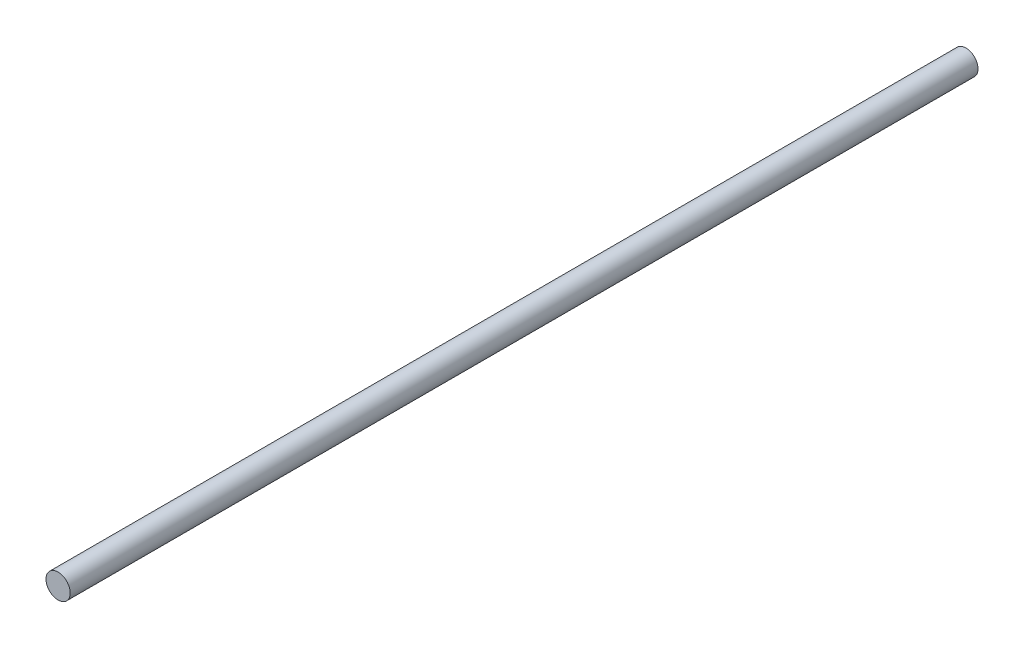
ISO-10303-21;
HEADER;
FILE_DESCRIPTION(('STEP AP214'),'2;1');
FILE_NAME('part.step','',(''),(''),'','','');
FILE_SCHEMA(('AUTOMOTIVE_DESIGN { 1 0 10303 214 1 1 1 1 }'));
ENDSEC;
DATA;
#1=APPLICATION_CONTEXT('core data for automotive mechanical design processes');
#2=APPLICATION_PROTOCOL_DEFINITION('international standard','automotive_design',2000,#1);
#3=PRODUCT_CONTEXT('',#1,'mechanical');
#4=PRODUCT('Part','Part','',(#3));
#5=PRODUCT_RELATED_PRODUCT_CATEGORY('part','',(#4));
#6=PRODUCT_DEFINITION_FORMATION('','',#4);
#7=PRODUCT_DEFINITION_CONTEXT('part definition',#1,'design');
#8=PRODUCT_DEFINITION('design','',#6,#7);
#9=PRODUCT_DEFINITION_SHAPE('','',#8);
#10=(LENGTH_UNIT() NAMED_UNIT(*) SI_UNIT(.MILLI.,.METRE.));
#11=(NAMED_UNIT(*) PLANE_ANGLE_UNIT() SI_UNIT($,.RADIAN.));
#12=(NAMED_UNIT(*) SI_UNIT($,.STERADIAN.) SOLID_ANGLE_UNIT());
#13=UNCERTAINTY_MEASURE_WITH_UNIT(LENGTH_MEASURE(1.E-05),#10,'distance_accuracy_value','');
#14=(GEOMETRIC_REPRESENTATION_CONTEXT(3) GLOBAL_UNCERTAINTY_ASSIGNED_CONTEXT((#13)) GLOBAL_UNIT_ASSIGNED_CONTEXT((#10,
#11,#12)) REPRESENTATION_CONTEXT('',''));
#15=CARTESIAN_POINT('',(0.,0.,0.));
#16=DIRECTION('',(0.,0.,1.));
#17=DIRECTION('',(1.,0.,0.));
#18=AXIS2_PLACEMENT_3D('',#15,#16,#17);
#19=CARTESIAN_POINT('',(0.,0.,75.));
#20=DIRECTION('',(0.,0.,-1.));
#21=DIRECTION('',(-1.,0.,0.));
#22=AXIS2_PLACEMENT_3D('',#19,#20,#21);
#23=CYLINDRICAL_SURFACE('',#22,1.);
#24=CARTESIAN_POINT('',(0.,0.,75.));
#25=DIRECTION('',(0.,0.,1.));
#26=DIRECTION('',(1.,0.,0.));
#27=AXIS2_PLACEMENT_3D('',#24,#25,#26);
#28=CIRCLE('',#27,1.);
#29=CARTESIAN_POINT('',(1.,0.,75.));
#30=VERTEX_POINT('',#29);
#31=EDGE_CURVE('E10',#30,#30,#28,.T.);
#32=ORIENTED_EDGE('',*,*,#31,.F.);
#33=EDGE_LOOP('',(#32));
#34=FACE_BOUND('',#33,.T.);
#35=CARTESIAN_POINT('',(0.,0.,0.));
#36=DIRECTION('',(0.,0.,1.));
#37=DIRECTION('',(1.,0.,0.));
#38=AXIS2_PLACEMENT_3D('',#35,#36,#37);
#39=CIRCLE('',#38,1.);
#40=CARTESIAN_POINT('',(1.,0.,0.));
#41=VERTEX_POINT('',#40);
#42=EDGE_CURVE('E35',#41,#41,#39,.T.);
#43=ORIENTED_EDGE('',*,*,#42,.T.);
#44=EDGE_LOOP('',(#43));
#45=FACE_BOUND('',#44,.T.);
#46=ADVANCED_FACE('F32',(#34,#45),#23,.T.);
#47=CARTESIAN_POINT('',(0.,0.,75.));
#48=DIRECTION('',(0.,0.,1.));
#49=DIRECTION('',(1.,0.,0.));
#50=AXIS2_PLACEMENT_3D('',#47,#48,#49);
#51=PLANE('',#50);
#52=ORIENTED_EDGE('',*,*,#31,.T.);
#53=EDGE_LOOP('',(#52));
#54=FACE_BOUND('',#53,.T.);
#55=ADVANCED_FACE('F47',(#54),#51,.T.);
#56=CARTESIAN_POINT('',(0.,0.,0.));
#57=DIRECTION('',(0.,0.,1.));
#58=DIRECTION('',(1.,0.,0.));
#59=AXIS2_PLACEMENT_3D('',#56,#57,#58);
#60=PLANE('',#59);
#61=ORIENTED_EDGE('',*,*,#42,.F.);
#62=EDGE_LOOP('',(#61));
#63=FACE_BOUND('',#62,.T.);
#64=ADVANCED_FACE('F45',(#63),#60,.F.);
#65=CLOSED_SHELL('',(#46,#55,#64));
#66=MANIFOLD_SOLID_BREP('B2',#65);
#67=ADVANCED_BREP_SHAPE_REPRESENTATION('',(#18,#66),#14);
#68=SHAPE_DEFINITION_REPRESENTATION(#9,#67);
ENDSEC;
END-ISO-10303-21;
